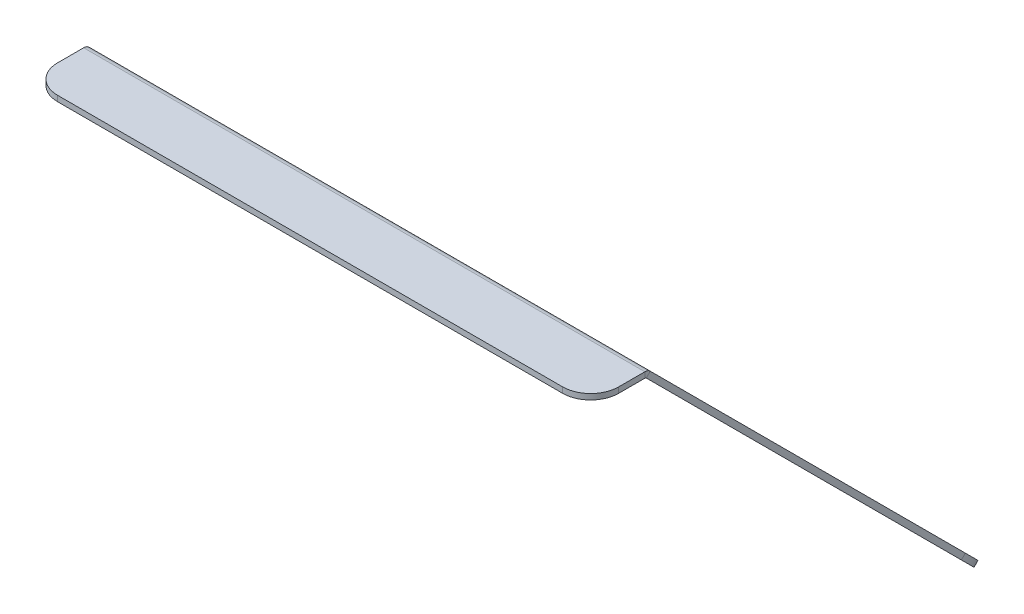
ISO-10303-21;
HEADER;
FILE_DESCRIPTION(('STEP AP214'),'2;1');
FILE_NAME('part.step','',(''),(''),'','','');
FILE_SCHEMA(('AUTOMOTIVE_DESIGN { 1 0 10303 214 1 1 1 1 }'));
ENDSEC;
DATA;
#1=APPLICATION_CONTEXT('core data for automotive mechanical design processes');
#2=APPLICATION_PROTOCOL_DEFINITION('international standard','automotive_design',2000,#1);
#3=PRODUCT_CONTEXT('',#1,'mechanical');
#4=PRODUCT('Part','Part','',(#3));
#5=PRODUCT_RELATED_PRODUCT_CATEGORY('part','',(#4));
#6=PRODUCT_DEFINITION_FORMATION('','',#4);
#7=PRODUCT_DEFINITION_CONTEXT('part definition',#1,'design');
#8=PRODUCT_DEFINITION('design','',#6,#7);
#9=PRODUCT_DEFINITION_SHAPE('','',#8);
#10=(LENGTH_UNIT() NAMED_UNIT(*) SI_UNIT(.MILLI.,.METRE.));
#11=(NAMED_UNIT(*) PLANE_ANGLE_UNIT() SI_UNIT($,.RADIAN.));
#12=(NAMED_UNIT(*) SI_UNIT($,.STERADIAN.) SOLID_ANGLE_UNIT());
#13=UNCERTAINTY_MEASURE_WITH_UNIT(LENGTH_MEASURE(1.E-05),#10,'distance_accuracy_value','');
#14=(GEOMETRIC_REPRESENTATION_CONTEXT(3) GLOBAL_UNCERTAINTY_ASSIGNED_CONTEXT((#13)) GLOBAL_UNIT_ASSIGNED_CONTEXT((#10,
#11,#12)) REPRESENTATION_CONTEXT('',''));
#15=CARTESIAN_POINT('',(0.,0.,0.));
#16=DIRECTION('',(0.,0.,1.));
#17=DIRECTION('',(1.,0.,0.));
#18=AXIS2_PLACEMENT_3D('',#15,#16,#17);
#19=CARTESIAN_POINT('',(80.4190145025555,-114.517057337332,-22.768727575931));
#20=DIRECTION('',(0.,0.707106781186546,-0.707106781186549));
#21=DIRECTION('',(0.,0.707106781186549,0.707106781186546));
#22=AXIS2_PLACEMENT_3D('',#19,#20,#21);
#23=PLANE('',#22);
#24=DIRECTION('',(-1.,0.,0.));
#25=VECTOR('',#24,1.);
#26=CARTESIAN_POINT('',(15.4190145025555,-53.3523207646957,38.3960089967052));
#27=LINE('',#26,#25);
#28=CARTESIAN_POINT('',(65.4190145025556,-53.3523207646957,38.3960089967052));
#29=VERTEX_POINT('',#28);
#30=CARTESIAN_POINT('',(15.4190145025555,-53.3523207646957,38.3960089967052));
#31=VERTEX_POINT('',#30);
#32=EDGE_CURVE('E289',#29,#31,#27,.T.);
#33=ORIENTED_EDGE('',*,*,#32,.T.);
#34=DIRECTION('',(0.,0.707106781186549,0.707106781186546));
#35=VECTOR('',#34,1.);
#36=CARTESIAN_POINT('',(15.4190145025556,-17.9969817053682,73.7513480560325));
#37=LINE('',#36,#35);
#38=CARTESIAN_POINT('',(15.4190145025556,-17.9969817053682,73.7513480560325));
#39=VERTEX_POINT('',#38);
#40=EDGE_CURVE('E276',#31,#39,#37,.T.);
#41=ORIENTED_EDGE('',*,*,#40,.T.);
#42=DIRECTION('',(1.,0.,0.));
#43=VECTOR('',#42,1.);
#44=CARTESIAN_POINT('',(15.4190145025556,-17.9969817053682,73.7513480560325));
#45=LINE('',#44,#43);
#46=CARTESIAN_POINT('',(65.4190145025556,-17.9969817053682,73.7513480560325));
#47=VERTEX_POINT('',#46);
#48=EDGE_CURVE('E280',#39,#47,#45,.T.);
#49=ORIENTED_EDGE('',*,*,#48,.T.);
#50=DIRECTION('',(0.,-0.707106781186549,-0.707106781186546));
#51=VECTOR('',#50,1.);
#52=CARTESIAN_POINT('',(65.4190145025556,-17.9969817053682,73.7513480560325));
#53=LINE('',#52,#51);
#54=EDGE_CURVE('E285',#47,#29,#53,.T.);
#55=ORIENTED_EDGE('',*,*,#54,.T.);
#56=EDGE_LOOP('',(#33,#41,#49,#55));
#57=FACE_BOUND('',#56,.T.);
#58=DIRECTION('',(-1.,0.,0.));
#59=VECTOR('',#58,1.);
#60=CARTESIAN_POINT('',(-14.5809854974445,-53.3523207646957,38.3960089967052));
#61=LINE('',#60,#59);
#62=CARTESIAN_POINT('',(-14.5809854974445,-53.3523207646957,38.3960089967052));
#63=VERTEX_POINT('',#62);
#64=CARTESIAN_POINT('',(-64.5809854974445,-53.3523207646957,38.3960089967052));
#65=VERTEX_POINT('',#64);
#66=EDGE_CURVE('E335',#63,#65,#61,.T.);
#67=ORIENTED_EDGE('',*,*,#66,.T.);
#68=DIRECTION('',(0.,0.707106781186549,0.707106781186546));
#69=VECTOR('',#68,1.);
#70=CARTESIAN_POINT('',(-64.5809854974445,-17.9969817053682,73.7513480560325));
#71=LINE('',#70,#69);
#72=CARTESIAN_POINT('',(-64.5809854974445,-17.9969817053682,73.7513480560325));
#73=VERTEX_POINT('',#72);
#74=EDGE_CURVE('E322',#65,#73,#71,.T.);
#75=ORIENTED_EDGE('',*,*,#74,.T.);
#76=DIRECTION('',(1.,0.,0.));
#77=VECTOR('',#76,1.);
#78=CARTESIAN_POINT('',(-14.5809854974444,-17.9969817053682,73.7513480560325));
#79=LINE('',#78,#77);
#80=CARTESIAN_POINT('',(-14.5809854974444,-17.9969817053683,73.7513480560325));
#81=VERTEX_POINT('',#80);
#82=EDGE_CURVE('E326',#73,#81,#79,.T.);
#83=ORIENTED_EDGE('',*,*,#82,.T.);
#84=DIRECTION('',(0.,-0.707106781186549,-0.707106781186546));
#85=VECTOR('',#84,1.);
#86=CARTESIAN_POINT('',(-14.5809854974444,-17.9969817053682,73.7513480560325));
#87=LINE('',#86,#85);
#88=EDGE_CURVE('E331',#81,#63,#87,.T.);
#89=ORIENTED_EDGE('',*,*,#88,.T.);
#90=EDGE_LOOP('',(#67,#75,#83,#89));
#91=FACE_BOUND('',#90,.T.);
#92=DIRECTION('',(1.,0.,0.));
#93=VECTOR('',#92,1.);
#94=CARTESIAN_POINT('',(-25.5809854974445,-110.981523431399,-19.2331936699983));
#95=LINE('',#94,#93);
#96=CARTESIAN_POINT('',(-25.5809854974445,-110.981523431399,-19.2331936699983));
#97=VERTEX_POINT('',#96);
#98=CARTESIAN_POINT('',(26.4190145025555,-110.981523431399,-19.2331936699983));
#99=VERTEX_POINT('',#98);
#100=EDGE_CURVE('E379',#97,#99,#95,.T.);
#101=ORIENTED_EDGE('',*,*,#100,.T.);
#102=DIRECTION('',(0.,-0.707106781186549,-0.707106781186546));
#103=VECTOR('',#102,1.);
#104=CARTESIAN_POINT('',(26.4190145025555,-110.981523431399,-19.2331936699983));
#105=LINE('',#104,#103);
#106=CARTESIAN_POINT('',(26.4190145025556,-121.588125149198,-29.8397953877965));
#107=VERTEX_POINT('',#106);
#108=EDGE_CURVE('E366',#99,#107,#105,.T.);
#109=ORIENTED_EDGE('',*,*,#108,.T.);
#110=DIRECTION('',(-1.,0.,0.));
#111=VECTOR('',#110,1.);
#112=CARTESIAN_POINT('',(-25.5809854974445,-121.588125149198,-29.8397953877965));
#113=LINE('',#112,#111);
#114=CARTESIAN_POINT('',(-25.5809854974445,-121.588125149198,-29.8397953877965));
#115=VERTEX_POINT('',#114);
#116=EDGE_CURVE('E370',#107,#115,#113,.T.);
#117=ORIENTED_EDGE('',*,*,#116,.T.);
#118=DIRECTION('',(0.,0.707106781186549,0.707106781186546));
#119=VECTOR('',#118,1.);
#120=CARTESIAN_POINT('',(-25.5809854974445,-110.981523431399,-19.2331936699983));
#121=LINE('',#120,#119);
#122=EDGE_CURVE('E375',#115,#97,#121,.T.);
#123=ORIENTED_EDGE('',*,*,#122,.T.);
#124=EDGE_LOOP('',(#101,#109,#117,#123));
#125=FACE_BOUND('',#124,.T.);
#126=CARTESIAN_POINT('',(-69.5809854974445,-84.1114657463105,7.63686401509044));
#127=DIRECTION('',(0.,0.707106781186546,-0.707106781186549));
#128=DIRECTION('',(0.,0.707106781186549,0.707106781186546));
#129=AXIS2_PLACEMENT_3D('',#126,#127,#128);
#130=CIRCLE('',#129,1.54999999999999);
#131=CARTESIAN_POINT('',(-69.5809854974445,-83.0154502354714,8.73287952592958));
#132=VERTEX_POINT('',#131);
#133=EDGE_CURVE('E410',#132,#132,#130,.T.);
#134=ORIENTED_EDGE('',*,*,#133,.T.);
#135=EDGE_LOOP('',(#134));
#136=FACE_BOUND('',#135,.T.);
#137=CARTESIAN_POINT('',(70.4190145025556,-84.1114657463106,7.63686401509045));
#138=DIRECTION('',(0.,0.707106781186546,-0.707106781186549));
#139=DIRECTION('',(0.,0.707106781186549,0.707106781186546));
#140=AXIS2_PLACEMENT_3D('',#137,#138,#139);
#141=CIRCLE('',#140,1.54999999999999);
#142=CARTESIAN_POINT('',(70.4190145025556,-83.0154502354714,8.73287952592959));
#143=VERTEX_POINT('',#142);
#144=EDGE_CURVE('E418',#143,#143,#141,.T.);
#145=ORIENTED_EDGE('',*,*,#144,.T.);
#146=EDGE_LOOP('',(#145));
#147=FACE_BOUND('',#146,.T.);
#148=DIRECTION('',(0.,-0.707106781186549,-0.707106781186546));
#149=VECTOR('',#148,1.);
#150=CARTESIAN_POINT('',(100.419014502556,-114.517057337332,-22.7687275759309));
#151=LINE('',#150,#149);
#152=CARTESIAN_POINT('',(100.419014502556,-2.21574514497799,89.5325846164227));
#153=VERTEX_POINT('',#152);
#154=CARTESIAN_POINT('',(100.419014502556,-114.517057337332,-22.7687275759309));
#155=VERTEX_POINT('',#154);
#156=EDGE_CURVE('E50',#153,#155,#151,.T.);
#157=ORIENTED_EDGE('',*,*,#156,.F.);
#158=DIRECTION('',(-1.,0.,0.));
#159=VECTOR('',#158,1.);
#160=CARTESIAN_POINT('',(80.4190145025555,-2.21574514497799,89.5325846164227));
#161=LINE('',#160,#159);
#162=CARTESIAN_POINT('',(-99.5809854974445,-2.215745144978,89.5325846164227));
#163=VERTEX_POINT('',#162);
#164=EDGE_CURVE('E235',#153,#163,#161,.T.);
#165=ORIENTED_EDGE('',*,*,#164,.T.);
#166=DIRECTION('',(0.,0.707106781186549,0.707106781186546));
#167=VECTOR('',#166,1.);
#168=CARTESIAN_POINT('',(-99.5809854974445,-114.517057337332,-22.768727575931));
#169=LINE('',#168,#167);
#170=CARTESIAN_POINT('',(-99.5809854974445,-114.517057337332,-22.768727575931));
#171=VERTEX_POINT('',#170);
#172=EDGE_CURVE('E438',#171,#163,#169,.T.);
#173=ORIENTED_EDGE('',*,*,#172,.F.);
#174=CARTESIAN_POINT('',(-79.5809854974445,-114.517057337332,-22.7687275759311));
#175=DIRECTION('',(0.,0.707106781186546,-0.707106781186549));
#176=DIRECTION('',(0.,-0.707106781186549,-0.707106781186546));
#177=AXIS2_PLACEMENT_3D('',#174,#175,#176);
#178=CIRCLE('',#177,20.);
#179=CARTESIAN_POINT('',(-79.5809854974445,-128.659192961063,-36.910863199662));
#180=VERTEX_POINT('',#179);
#181=EDGE_CURVE('E434',#180,#171,#178,.T.);
#182=ORIENTED_EDGE('',*,*,#181,.F.);
#183=DIRECTION('',(-1.,0.,0.));
#184=VECTOR('',#183,1.);
#185=CARTESIAN_POINT('',(-79.5809854974443,-128.659192961063,-36.910863199662));
#186=LINE('',#185,#184);
#187=CARTESIAN_POINT('',(80.4190145025554,-128.659192961063,-36.910863199662));
#188=VERTEX_POINT('',#187);
#189=EDGE_CURVE('E430',#188,#180,#186,.T.);
#190=ORIENTED_EDGE('',*,*,#189,.F.);
#191=CARTESIAN_POINT('',(80.4190145025555,-114.517057337332,-22.768727575931));
#192=DIRECTION('',(0.,0.707106781186546,-0.707106781186549));
#193=DIRECTION('',(0.,0.707106781186549,0.707106781186546));
#194=AXIS2_PLACEMENT_3D('',#191,#192,#193);
#195=CIRCLE('',#194,20.);
#196=EDGE_CURVE('E426',#155,#188,#195,.T.);
#197=ORIENTED_EDGE('',*,*,#196,.F.);
#198=EDGE_LOOP('',(#157,#165,#173,#182,#190,#197));
#199=FACE_BOUND('',#198,.T.);
#200=ADVANCED_FACE('F46',(#57,#91,#125,#136,#147,#199),#23,.F.);
#201=CARTESIAN_POINT('',(80.4190145025555,-114.517057337332,-22.768727575931));
#202=DIRECTION('',(0.,0.707106781186546,-0.707106781186549));
#203=DIRECTION('',(0.,0.707106781186549,0.707106781186546));
#204=AXIS2_PLACEMENT_3D('',#201,#202,#203);
#205=CYLINDRICAL_SURFACE('',#204,20.);
#206=CARTESIAN_POINT('',(80.4190145025555,-113.102843774959,-24.1829411383041));
#207=DIRECTION('',(0.,0.707106781186546,-0.707106781186549));
#208=DIRECTION('',(0.,0.707106781186549,0.707106781186546));
#209=AXIS2_PLACEMENT_3D('',#206,#207,#208);
#210=CIRCLE('',#209,20.);
#211=CARTESIAN_POINT('',(100.419014502556,-113.102843774959,-24.182941138304));
#212=VERTEX_POINT('',#211);
#213=CARTESIAN_POINT('',(80.4190145025554,-127.24497939869,-38.3250767620351));
#214=VERTEX_POINT('',#213);
#215=EDGE_CURVE('E422',#212,#214,#210,.T.);
#216=ORIENTED_EDGE('',*,*,#215,.F.);
#217=DIRECTION('',(0.,0.707106781186546,-0.707106781186549));
#218=VECTOR('',#217,1.);
#219=CARTESIAN_POINT('',(100.419014502556,-114.517057337332,-22.7687275759309));
#220=LINE('',#219,#218);
#221=EDGE_CURVE('E449',#155,#212,#220,.T.);
#222=ORIENTED_EDGE('',*,*,#221,.F.);
#223=ORIENTED_EDGE('',*,*,#196,.T.);
#224=DIRECTION('',(0.,0.707106781186546,-0.707106781186549));
#225=VECTOR('',#224,1.);
#226=CARTESIAN_POINT('',(80.4190145025554,-128.659192961063,-36.910863199662));
#227=LINE('',#226,#225);
#228=EDGE_CURVE('E458',#188,#214,#227,.T.);
#229=ORIENTED_EDGE('',*,*,#228,.T.);
#230=EDGE_LOOP('',(#216,#222,#223,#229));
#231=FACE_BOUND('',#230,.T.);
#232=ADVANCED_FACE('F480',(#231),#205,.T.);
#233=CARTESIAN_POINT('',(100.419014502556,-114.517057337332,-22.7687275759309));
#234=DIRECTION('',(1.,0.,0.));
#235=DIRECTION('',(0.,-0.707106781186549,-0.707106781186546));
#236=AXIS2_PLACEMENT_3D('',#233,#234,#235);
#237=PLANE('',#236);
#238=DIRECTION('',(0.,0.707106781186546,-0.707106781186549));
#239=VECTOR('',#238,1.);
#240=CARTESIAN_POINT('',(100.419014502556,-2.215745144978,89.5325846164227));
#241=LINE('',#240,#239);
#242=CARTESIAN_POINT('',(100.419014502556,-0.801531582604903,88.1183710540496));
#243=VERTEX_POINT('',#242);
#244=EDGE_CURVE('E463',#153,#243,#241,.T.);
#245=ORIENTED_EDGE('',*,*,#244,.F.);
#246=ORIENTED_EDGE('',*,*,#156,.T.);
#247=ORIENTED_EDGE('',*,*,#221,.T.);
#248=DIRECTION('',(0.,-0.707106781186549,-0.707106781186546));
#249=VECTOR('',#248,1.);
#250=CARTESIAN_POINT('',(100.419014502556,-113.102843774959,-24.182941138304));
#251=LINE('',#250,#249);
#252=EDGE_CURVE('E72',#243,#212,#251,.T.);
#253=ORIENTED_EDGE('',*,*,#252,.F.);
#254=EDGE_LOOP('',(#245,#246,#247,#253));
#255=FACE_BOUND('',#254,.T.);
#256=ADVANCED_FACE('F477',(#255),#237,.T.);
#257=CARTESIAN_POINT('',(-99.5809854974445,-114.517057337332,-22.768727575931));
#258=DIRECTION('',(-1.,0.,0.));
#259=DIRECTION('',(0.,0.707106781186549,0.707106781186546));
#260=AXIS2_PLACEMENT_3D('',#257,#258,#259);
#261=PLANE('',#260);
#262=DIRECTION('',(0.,-0.707106781186546,0.707106781186549));
#263=VECTOR('',#262,1.);
#264=CARTESIAN_POINT('',(-99.5809854974445,-2.21574514497801,89.5325846164227));
#265=LINE('',#264,#263);
#266=CARTESIAN_POINT('',(-99.5809854974445,-0.801531582604931,88.1183710540496));
#267=VERTEX_POINT('',#266);
#268=EDGE_CURVE('E12',#267,#163,#265,.T.);
#269=ORIENTED_EDGE('',*,*,#268,.F.);
#270=DIRECTION('',(0.,0.707106781186549,0.707106781186546));
#271=VECTOR('',#270,1.);
#272=CARTESIAN_POINT('',(-99.5809854974445,-113.102843774959,-24.1829411383041));
#273=LINE('',#272,#271);
#274=CARTESIAN_POINT('',(-99.5809854974445,-113.102843774959,-24.1829411383041));
#275=VERTEX_POINT('',#274);
#276=EDGE_CURVE('E64',#275,#267,#273,.T.);
#277=ORIENTED_EDGE('',*,*,#276,.F.);
#278=DIRECTION('',(0.,0.707106781186546,-0.707106781186549));
#279=VECTOR('',#278,1.);
#280=CARTESIAN_POINT('',(-99.5809854974445,-114.517057337332,-22.768727575931));
#281=LINE('',#280,#279);
#282=EDGE_CURVE('E452',#171,#275,#281,.T.);
#283=ORIENTED_EDGE('',*,*,#282,.F.);
#284=ORIENTED_EDGE('',*,*,#172,.T.);
#285=EDGE_LOOP('',(#269,#277,#283,#284));
#286=FACE_BOUND('',#285,.T.);
#287=ADVANCED_FACE('F48',(#286),#261,.T.);
#288=CARTESIAN_POINT('',(-79.5809854974445,-114.517057337332,-22.7687275759311));
#289=DIRECTION('',(0.,0.707106781186546,-0.707106781186549));
#290=DIRECTION('',(0.,0.707106781186549,0.707106781186546));
#291=AXIS2_PLACEMENT_3D('',#288,#289,#290);
#292=CYLINDRICAL_SURFACE('',#291,20.);
#293=CARTESIAN_POINT('',(-79.5809854974445,-113.102843774959,-24.1829411383042));
#294=DIRECTION('',(0.,0.707106781186546,-0.707106781186549));
#295=DIRECTION('',(0.,-0.707106781186549,-0.707106781186546));
#296=AXIS2_PLACEMENT_3D('',#293,#294,#295);
#297=CIRCLE('',#296,20.);
#298=CARTESIAN_POINT('',(-79.5809854974445,-127.24497939869,-38.3250767620351));
#299=VERTEX_POINT('',#298);
#300=EDGE_CURVE('E446',#299,#275,#297,.T.);
#301=ORIENTED_EDGE('',*,*,#300,.F.);
#302=DIRECTION('',(0.,0.707106781186546,-0.707106781186549));
#303=VECTOR('',#302,1.);
#304=CARTESIAN_POINT('',(-79.5809854974445,-128.659192961063,-36.910863199662));
#305=LINE('',#304,#303);
#306=EDGE_CURVE('E455',#180,#299,#305,.T.);
#307=ORIENTED_EDGE('',*,*,#306,.F.);
#308=ORIENTED_EDGE('',*,*,#181,.T.);
#309=ORIENTED_EDGE('',*,*,#282,.T.);
#310=EDGE_LOOP('',(#301,#307,#308,#309));
#311=FACE_BOUND('',#310,.T.);
#312=ADVANCED_FACE('F487',(#311),#292,.T.);
#313=CARTESIAN_POINT('',(-79.5809854974443,-128.659192961063,-36.910863199662));
#314=DIRECTION('',(0.,-0.707106781186549,-0.707106781186546));
#315=DIRECTION('',(-1.,0.,0.));
#316=AXIS2_PLACEMENT_3D('',#313,#314,#315);
#317=PLANE('',#316);
#318=DIRECTION('',(-1.,0.,0.));
#319=VECTOR('',#318,1.);
#320=CARTESIAN_POINT('',(-79.5809854974443,-127.24497939869,-38.3250767620351));
#321=LINE('',#320,#319);
#322=EDGE_CURVE('E442',#214,#299,#321,.T.);
#323=ORIENTED_EDGE('',*,*,#322,.F.);
#324=ORIENTED_EDGE('',*,*,#228,.F.);
#325=ORIENTED_EDGE('',*,*,#189,.T.);
#326=ORIENTED_EDGE('',*,*,#306,.T.);
#327=EDGE_LOOP('',(#323,#324,#325,#326));
#328=FACE_BOUND('',#327,.T.);
#329=ADVANCED_FACE('F484',(#328),#317,.T.);
#330=CARTESIAN_POINT('',(80.4190145025555,-113.102843774959,-24.1829411383041));
#331=DIRECTION('',(0.,0.707106781186546,-0.707106781186549));
#332=DIRECTION('',(0.,0.707106781186549,0.707106781186546));
#333=AXIS2_PLACEMENT_3D('',#330,#331,#332);
#334=PLANE('',#333);
#335=DIRECTION('',(-1.,0.,0.));
#336=VECTOR('',#335,1.);
#337=CARTESIAN_POINT('',(80.4190145025555,-0.801531582604903,88.1183710540496));
#338=LINE('',#337,#336);
#339=EDGE_CURVE('E56',#243,#267,#338,.T.);
#340=ORIENTED_EDGE('',*,*,#339,.F.);
#341=ORIENTED_EDGE('',*,*,#252,.T.);
#342=ORIENTED_EDGE('',*,*,#215,.T.);
#343=ORIENTED_EDGE('',*,*,#322,.T.);
#344=ORIENTED_EDGE('',*,*,#300,.T.);
#345=ORIENTED_EDGE('',*,*,#276,.T.);
#346=EDGE_LOOP('',(#340,#341,#342,#343,#344,#345));
#347=FACE_BOUND('',#346,.T.);
#348=DIRECTION('',(0.,0.707106781186549,0.707106781186546));
#349=VECTOR('',#348,1.);
#350=CARTESIAN_POINT('',(15.4190145025556,-16.5827681429951,72.3371344936594));
#351=LINE('',#350,#349);
#352=CARTESIAN_POINT('',(15.4190145025555,-51.9381072023226,36.9817954343321));
#353=VERTEX_POINT('',#352);
#354=CARTESIAN_POINT('',(15.4190145025556,-16.5827681429951,72.3371344936594));
#355=VERTEX_POINT('',#354);
#356=EDGE_CURVE('E294',#353,#355,#351,.T.);
#357=ORIENTED_EDGE('',*,*,#356,.F.);
#358=DIRECTION('',(-1.,0.,0.));
#359=VECTOR('',#358,1.);
#360=CARTESIAN_POINT('',(15.4190145025555,-51.9381072023226,36.9817954343321));
#361=LINE('',#360,#359);
#362=CARTESIAN_POINT('',(65.4190145025556,-51.9381072023226,36.9817954343321));
#363=VERTEX_POINT('',#362);
#364=EDGE_CURVE('E281',#363,#353,#361,.T.);
#365=ORIENTED_EDGE('',*,*,#364,.F.);
#366=DIRECTION('',(0.,-0.707106781186549,-0.707106781186546));
#367=VECTOR('',#366,1.);
#368=CARTESIAN_POINT('',(65.4190145025556,-16.5827681429952,72.3371344936594));
#369=LINE('',#368,#367);
#370=CARTESIAN_POINT('',(65.4190145025556,-16.5827681429952,72.3371344936594));
#371=VERTEX_POINT('',#370);
#372=EDGE_CURVE('E302',#371,#363,#369,.T.);
#373=ORIENTED_EDGE('',*,*,#372,.F.);
#374=DIRECTION('',(1.,0.,0.));
#375=VECTOR('',#374,1.);
#376=CARTESIAN_POINT('',(15.4190145025556,-16.5827681429951,72.3371344936594));
#377=LINE('',#376,#375);
#378=EDGE_CURVE('E297',#355,#371,#377,.T.);
#379=ORIENTED_EDGE('',*,*,#378,.F.);
#380=EDGE_LOOP('',(#357,#365,#373,#379));
#381=FACE_BOUND('',#380,.T.);
#382=DIRECTION('',(0.,0.707106781186549,0.707106781186546));
#383=VECTOR('',#382,1.);
#384=CARTESIAN_POINT('',(-64.5809854974445,-16.5827681429951,72.3371344936594));
#385=LINE('',#384,#383);
#386=CARTESIAN_POINT('',(-64.5809854974445,-51.9381072023226,36.9817954343321));
#387=VERTEX_POINT('',#386);
#388=CARTESIAN_POINT('',(-64.5809854974445,-16.5827681429952,72.3371344936594));
#389=VERTEX_POINT('',#388);
#390=EDGE_CURVE('E312',#387,#389,#385,.T.);
#391=ORIENTED_EDGE('',*,*,#390,.F.);
#392=DIRECTION('',(-1.,0.,0.));
#393=VECTOR('',#392,1.);
#394=CARTESIAN_POINT('',(-14.5809854974445,-51.9381072023226,36.9817954343321));
#395=LINE('',#394,#393);
#396=CARTESIAN_POINT('',(-14.5809854974445,-51.9381072023226,36.9817954343321));
#397=VERTEX_POINT('',#396);
#398=EDGE_CURVE('E327',#397,#387,#395,.T.);
#399=ORIENTED_EDGE('',*,*,#398,.F.);
#400=DIRECTION('',(0.,-0.707106781186549,-0.707106781186546));
#401=VECTOR('',#400,1.);
#402=CARTESIAN_POINT('',(-14.5809854974444,-16.5827681429952,72.3371344936594));
#403=LINE('',#402,#401);
#404=CARTESIAN_POINT('',(-14.5809854974444,-16.5827681429952,72.3371344936594));
#405=VERTEX_POINT('',#404);
#406=EDGE_CURVE('E346',#405,#397,#403,.T.);
#407=ORIENTED_EDGE('',*,*,#406,.F.);
#408=DIRECTION('',(1.,0.,0.));
#409=VECTOR('',#408,1.);
#410=CARTESIAN_POINT('',(-14.5809854974444,-16.5827681429952,72.3371344936594));
#411=LINE('',#410,#409);
#412=EDGE_CURVE('E342',#389,#405,#411,.T.);
#413=ORIENTED_EDGE('',*,*,#412,.F.);
#414=EDGE_LOOP('',(#391,#399,#407,#413));
#415=FACE_BOUND('',#414,.T.);
#416=DIRECTION('',(0.,-0.707106781186549,-0.707106781186546));
#417=VECTOR('',#416,1.);
#418=CARTESIAN_POINT('',(26.4190145025555,-109.567309869026,-20.6474072323714));
#419=LINE('',#418,#417);
#420=CARTESIAN_POINT('',(26.4190145025555,-109.567309869026,-20.6474072323714));
#421=VERTEX_POINT('',#420);
#422=CARTESIAN_POINT('',(26.4190145025556,-120.173911586825,-31.2540089501696));
#423=VERTEX_POINT('',#422);
#424=EDGE_CURVE('E356',#421,#423,#419,.T.);
#425=ORIENTED_EDGE('',*,*,#424,.F.);
#426=DIRECTION('',(1.,0.,0.));
#427=VECTOR('',#426,1.);
#428=CARTESIAN_POINT('',(-25.5809854974445,-109.567309869026,-20.6474072323714));
#429=LINE('',#428,#427);
#430=CARTESIAN_POINT('',(-25.5809854974445,-109.567309869026,-20.6474072323714));
#431=VERTEX_POINT('',#430);
#432=EDGE_CURVE('E371',#431,#421,#429,.T.);
#433=ORIENTED_EDGE('',*,*,#432,.F.);
#434=DIRECTION('',(0.,0.707106781186549,0.707106781186546));
#435=VECTOR('',#434,1.);
#436=CARTESIAN_POINT('',(-25.5809854974445,-109.567309869026,-20.6474072323714));
#437=LINE('',#436,#435);
#438=CARTESIAN_POINT('',(-25.5809854974445,-120.173911586825,-31.2540089501696));
#439=VERTEX_POINT('',#438);
#440=EDGE_CURVE('E390',#439,#431,#437,.T.);
#441=ORIENTED_EDGE('',*,*,#440,.F.);
#442=DIRECTION('',(-1.,0.,0.));
#443=VECTOR('',#442,1.);
#444=CARTESIAN_POINT('',(-25.5809854974445,-120.173911586825,-31.2540089501696));
#445=LINE('',#444,#443);
#446=EDGE_CURVE('E386',#423,#439,#445,.T.);
#447=ORIENTED_EDGE('',*,*,#446,.F.);
#448=EDGE_LOOP('',(#425,#433,#441,#447));
#449=FACE_BOUND('',#448,.T.);
#450=CARTESIAN_POINT('',(-69.5809854974445,-82.6972521839375,6.22265045271734));
#451=DIRECTION('',(0.,0.707106781186546,-0.707106781186549));
#452=DIRECTION('',(0.,0.707106781186549,0.707106781186546));
#453=AXIS2_PLACEMENT_3D('',#450,#451,#452);
#454=CIRCLE('',#453,1.54999999999999);
#455=CARTESIAN_POINT('',(-69.5809854974445,-81.6012366730983,7.31866596355648));
#456=VERTEX_POINT('',#455);
#457=EDGE_CURVE('E400',#456,#456,#454,.T.);
#458=ORIENTED_EDGE('',*,*,#457,.F.);
#459=EDGE_LOOP('',(#458));
#460=FACE_BOUND('',#459,.T.);
#461=CARTESIAN_POINT('',(70.4190145025556,-82.6972521839375,6.22265045271735));
#462=DIRECTION('',(0.,0.707106781186546,-0.707106781186549));
#463=DIRECTION('',(0.,0.707106781186549,0.707106781186546));
#464=AXIS2_PLACEMENT_3D('',#461,#462,#463);
#465=CIRCLE('',#464,1.54999999999999);
#466=CARTESIAN_POINT('',(70.4190145025556,-81.6012366730983,7.31866596355649));
#467=VERTEX_POINT('',#466);
#468=EDGE_CURVE('E414',#467,#467,#465,.T.);
#469=ORIENTED_EDGE('',*,*,#468,.F.);
#470=EDGE_LOOP('',(#469));
#471=FACE_BOUND('',#470,.T.);
#472=ADVANCED_FACE('F473',(#347,#381,#415,#449,#460,#471),#334,.T.);
#473=CARTESIAN_POINT('',(70.4190145025556,-84.1114657463106,7.63686401509045));
#474=DIRECTION('',(0.,0.707106781186546,-0.707106781186549));
#475=DIRECTION('',(0.,0.707106781186549,0.707106781186546));
#476=AXIS2_PLACEMENT_3D('',#473,#474,#475);
#477=CYLINDRICAL_SURFACE('',#476,1.54999999999999);
#478=ORIENTED_EDGE('',*,*,#144,.F.);
#479=EDGE_LOOP('',(#478));
#480=FACE_BOUND('',#479,.T.);
#481=ORIENTED_EDGE('',*,*,#468,.T.);
#482=EDGE_LOOP('',(#481));
#483=FACE_BOUND('',#482,.T.);
#484=ADVANCED_FACE('F568',(#480,#483),#477,.F.);
#485=CARTESIAN_POINT('',(-69.5809854974445,-84.1114657463105,7.63686401509044));
#486=DIRECTION('',(0.,0.707106781186546,-0.707106781186549));
#487=DIRECTION('',(0.,0.707106781186549,0.707106781186546));
#488=AXIS2_PLACEMENT_3D('',#485,#486,#487);
#489=CYLINDRICAL_SURFACE('',#488,1.54999999999999);
#490=ORIENTED_EDGE('',*,*,#133,.F.);
#491=EDGE_LOOP('',(#490));
#492=FACE_BOUND('',#491,.T.);
#493=ORIENTED_EDGE('',*,*,#457,.T.);
#494=EDGE_LOOP('',(#493));
#495=FACE_BOUND('',#494,.T.);
#496=ADVANCED_FACE('F573',(#492,#495),#489,.F.);
#497=CARTESIAN_POINT('',(26.4190145025555,-110.981523431399,-19.2331936699983));
#498=DIRECTION('',(1.,0.,0.));
#499=DIRECTION('',(0.,-0.707106781186549,-0.707106781186546));
#500=AXIS2_PLACEMENT_3D('',#497,#498,#499);
#501=PLANE('',#500);
#502=ORIENTED_EDGE('',*,*,#424,.T.);
#503=DIRECTION('',(0.,0.707106781186546,-0.707106781186549));
#504=VECTOR('',#503,1.);
#505=CARTESIAN_POINT('',(26.4190145025556,-121.588125149198,-29.8397953877965));
#506=LINE('',#505,#504);
#507=EDGE_CURVE('E383',#107,#423,#506,.T.);
#508=ORIENTED_EDGE('',*,*,#507,.F.);
#509=ORIENTED_EDGE('',*,*,#108,.F.);
#510=DIRECTION('',(0.,0.707106781186546,-0.707106781186549));
#511=VECTOR('',#510,1.);
#512=CARTESIAN_POINT('',(26.4190145025555,-110.981523431399,-19.2331936699983));
#513=LINE('',#512,#511);
#514=EDGE_CURVE('E397',#99,#421,#513,.T.);
#515=ORIENTED_EDGE('',*,*,#514,.T.);
#516=EDGE_LOOP('',(#502,#508,#509,#515));
#517=FACE_BOUND('',#516,.T.);
#518=ADVANCED_FACE('F583',(#517),#501,.F.);
#519=CARTESIAN_POINT('',(-25.5809854974445,-110.981523431399,-19.2331936699983));
#520=DIRECTION('',(0.,0.707106781186549,0.707106781186546));
#521=DIRECTION('',(1.,0.,0.));
#522=AXIS2_PLACEMENT_3D('',#519,#520,#521);
#523=PLANE('',#522);
#524=ORIENTED_EDGE('',*,*,#432,.T.);
#525=ORIENTED_EDGE('',*,*,#514,.F.);
#526=ORIENTED_EDGE('',*,*,#100,.F.);
#527=DIRECTION('',(0.,0.707106781186546,-0.707106781186549));
#528=VECTOR('',#527,1.);
#529=CARTESIAN_POINT('',(-25.5809854974445,-110.981523431399,-19.2331936699983));
#530=LINE('',#529,#528);
#531=EDGE_CURVE('E401',#97,#431,#530,.T.);
#532=ORIENTED_EDGE('',*,*,#531,.T.);
#533=EDGE_LOOP('',(#524,#525,#526,#532));
#534=FACE_BOUND('',#533,.T.);
#535=ADVANCED_FACE('F587',(#534),#523,.F.);
#536=CARTESIAN_POINT('',(-25.5809854974445,-110.981523431399,-19.2331936699983));
#537=DIRECTION('',(-1.,0.,0.));
#538=DIRECTION('',(0.,0.707106781186549,0.707106781186546));
#539=AXIS2_PLACEMENT_3D('',#536,#537,#538);
#540=PLANE('',#539);
#541=ORIENTED_EDGE('',*,*,#440,.T.);
#542=ORIENTED_EDGE('',*,*,#531,.F.);
#543=ORIENTED_EDGE('',*,*,#122,.F.);
#544=DIRECTION('',(0.,0.707106781186546,-0.707106781186549));
#545=VECTOR('',#544,1.);
#546=CARTESIAN_POINT('',(-25.5809854974445,-121.588125149198,-29.8397953877965));
#547=LINE('',#546,#545);
#548=EDGE_CURVE('E404',#115,#439,#547,.T.);
#549=ORIENTED_EDGE('',*,*,#548,.T.);
#550=EDGE_LOOP('',(#541,#542,#543,#549));
#551=FACE_BOUND('',#550,.T.);
#552=ADVANCED_FACE('F593',(#551),#540,.F.);
#553=CARTESIAN_POINT('',(-25.5809854974445,-121.588125149198,-29.8397953877965));
#554=DIRECTION('',(0.,-0.707106781186549,-0.707106781186546));
#555=DIRECTION('',(-1.,0.,0.));
#556=AXIS2_PLACEMENT_3D('',#553,#554,#555);
#557=PLANE('',#556);
#558=ORIENTED_EDGE('',*,*,#446,.T.);
#559=ORIENTED_EDGE('',*,*,#548,.F.);
#560=ORIENTED_EDGE('',*,*,#116,.F.);
#561=ORIENTED_EDGE('',*,*,#507,.T.);
#562=EDGE_LOOP('',(#558,#559,#560,#561));
#563=FACE_BOUND('',#562,.T.);
#564=ADVANCED_FACE('F589',(#563),#557,.F.);
#565=CARTESIAN_POINT('',(-64.5809854974445,-17.9969817053682,73.7513480560325));
#566=DIRECTION('',(-1.,0.,0.));
#567=DIRECTION('',(0.,0.707106781186549,0.707106781186546));
#568=AXIS2_PLACEMENT_3D('',#565,#566,#567);
#569=PLANE('',#568);
#570=ORIENTED_EDGE('',*,*,#390,.T.);
#571=DIRECTION('',(0.,0.707106781186546,-0.707106781186549));
#572=VECTOR('',#571,1.);
#573=CARTESIAN_POINT('',(-64.5809854974445,-17.9969817053682,73.7513480560325));
#574=LINE('',#573,#572);
#575=EDGE_CURVE('E339',#73,#389,#574,.T.);
#576=ORIENTED_EDGE('',*,*,#575,.F.);
#577=ORIENTED_EDGE('',*,*,#74,.F.);
#578=DIRECTION('',(0.,0.707106781186546,-0.707106781186549));
#579=VECTOR('',#578,1.);
#580=CARTESIAN_POINT('',(-64.5809854974445,-53.3523207646957,38.3960089967052));
#581=LINE('',#580,#579);
#582=EDGE_CURVE('E353',#65,#387,#581,.T.);
#583=ORIENTED_EDGE('',*,*,#582,.T.);
#584=EDGE_LOOP('',(#570,#576,#577,#583));
#585=FACE_BOUND('',#584,.T.);
#586=ADVANCED_FACE('F592',(#585),#569,.F.);
#587=CARTESIAN_POINT('',(-14.5809854974445,-53.3523207646957,38.3960089967052));
#588=DIRECTION('',(0.,-0.707106781186549,-0.707106781186546));
#589=DIRECTION('',(-1.,0.,0.));
#590=AXIS2_PLACEMENT_3D('',#587,#588,#589);
#591=PLANE('',#590);
#592=ORIENTED_EDGE('',*,*,#398,.T.);
#593=ORIENTED_EDGE('',*,*,#582,.F.);
#594=ORIENTED_EDGE('',*,*,#66,.F.);
#595=DIRECTION('',(0.,0.707106781186546,-0.707106781186549));
#596=VECTOR('',#595,1.);
#597=CARTESIAN_POINT('',(-14.5809854974445,-53.3523207646957,38.3960089967052));
#598=LINE('',#597,#596);
#599=EDGE_CURVE('E357',#63,#397,#598,.T.);
#600=ORIENTED_EDGE('',*,*,#599,.T.);
#601=EDGE_LOOP('',(#592,#593,#594,#600));
#602=FACE_BOUND('',#601,.T.);
#603=ADVANCED_FACE('F603',(#602),#591,.F.);
#604=CARTESIAN_POINT('',(-14.5809854974444,-17.9969817053682,73.7513480560325));
#605=DIRECTION('',(1.,0.,0.));
#606=DIRECTION('',(0.,-0.707106781186549,-0.707106781186546));
#607=AXIS2_PLACEMENT_3D('',#604,#605,#606);
#608=PLANE('',#607);
#609=ORIENTED_EDGE('',*,*,#406,.T.);
#610=ORIENTED_EDGE('',*,*,#599,.F.);
#611=ORIENTED_EDGE('',*,*,#88,.F.);
#612=DIRECTION('',(0.,0.707106781186546,-0.707106781186549));
#613=VECTOR('',#612,1.);
#614=CARTESIAN_POINT('',(-14.5809854974444,-17.9969817053682,73.7513480560325));
#615=LINE('',#614,#613);
#616=EDGE_CURVE('E360',#81,#405,#615,.T.);
#617=ORIENTED_EDGE('',*,*,#616,.T.);
#618=EDGE_LOOP('',(#609,#610,#611,#617));
#619=FACE_BOUND('',#618,.T.);
#620=ADVANCED_FACE('F609',(#619),#608,.F.);
#621=CARTESIAN_POINT('',(-14.5809854974444,-17.9969817053682,73.7513480560325));
#622=DIRECTION('',(0.,0.707106781186549,0.707106781186546));
#623=DIRECTION('',(1.,0.,0.));
#624=AXIS2_PLACEMENT_3D('',#621,#622,#623);
#625=PLANE('',#624);
#626=ORIENTED_EDGE('',*,*,#412,.T.);
#627=ORIENTED_EDGE('',*,*,#616,.F.);
#628=ORIENTED_EDGE('',*,*,#82,.F.);
#629=ORIENTED_EDGE('',*,*,#575,.T.);
#630=EDGE_LOOP('',(#626,#627,#628,#629));
#631=FACE_BOUND('',#630,.T.);
#632=ADVANCED_FACE('F605',(#631),#625,.F.);
#633=CARTESIAN_POINT('',(15.4190145025556,-17.9969817053682,73.7513480560325));
#634=DIRECTION('',(-1.,0.,0.));
#635=DIRECTION('',(0.,0.707106781186549,0.707106781186546));
#636=AXIS2_PLACEMENT_3D('',#633,#634,#635);
#637=PLANE('',#636);
#638=ORIENTED_EDGE('',*,*,#356,.T.);
#639=DIRECTION('',(0.,0.707106781186546,-0.707106781186549));
#640=VECTOR('',#639,1.);
#641=CARTESIAN_POINT('',(15.4190145025556,-17.9969817053682,73.7513480560325));
#642=LINE('',#641,#640);
#643=EDGE_CURVE('E293',#39,#355,#642,.T.);
#644=ORIENTED_EDGE('',*,*,#643,.F.);
#645=ORIENTED_EDGE('',*,*,#40,.F.);
#646=DIRECTION('',(0.,0.707106781186546,-0.707106781186549));
#647=VECTOR('',#646,1.);
#648=CARTESIAN_POINT('',(15.4190145025555,-53.3523207646957,38.3960089967052));
#649=LINE('',#648,#647);
#650=EDGE_CURVE('E309',#31,#353,#649,.T.);
#651=ORIENTED_EDGE('',*,*,#650,.T.);
#652=EDGE_LOOP('',(#638,#644,#645,#651));
#653=FACE_BOUND('',#652,.T.);
#654=ADVANCED_FACE('F608',(#653),#637,.F.);
#655=CARTESIAN_POINT('',(15.4190145025555,-53.3523207646957,38.3960089967052));
#656=DIRECTION('',(0.,-0.707106781186549,-0.707106781186546));
#657=DIRECTION('',(-1.,0.,0.));
#658=AXIS2_PLACEMENT_3D('',#655,#656,#657);
#659=PLANE('',#658);
#660=ORIENTED_EDGE('',*,*,#364,.T.);
#661=ORIENTED_EDGE('',*,*,#650,.F.);
#662=ORIENTED_EDGE('',*,*,#32,.F.);
#663=DIRECTION('',(0.,0.707106781186546,-0.707106781186549));
#664=VECTOR('',#663,1.);
#665=CARTESIAN_POINT('',(65.4190145025556,-53.3523207646957,38.3960089967052));
#666=LINE('',#665,#664);
#667=EDGE_CURVE('E313',#29,#363,#666,.T.);
#668=ORIENTED_EDGE('',*,*,#667,.T.);
#669=EDGE_LOOP('',(#660,#661,#662,#668));
#670=FACE_BOUND('',#669,.T.);
#671=ADVANCED_FACE('F619',(#670),#659,.F.);
#672=CARTESIAN_POINT('',(65.4190145025556,-17.9969817053682,73.7513480560325));
#673=DIRECTION('',(1.,0.,0.));
#674=DIRECTION('',(0.,-0.707106781186549,-0.707106781186546));
#675=AXIS2_PLACEMENT_3D('',#672,#673,#674);
#676=PLANE('',#675);
#677=ORIENTED_EDGE('',*,*,#372,.T.);
#678=ORIENTED_EDGE('',*,*,#667,.F.);
#679=ORIENTED_EDGE('',*,*,#54,.F.);
#680=DIRECTION('',(0.,0.707106781186546,-0.707106781186549));
#681=VECTOR('',#680,1.);
#682=CARTESIAN_POINT('',(65.4190145025556,-17.9969817053682,73.7513480560325));
#683=LINE('',#682,#681);
#684=EDGE_CURVE('E316',#47,#371,#683,.T.);
#685=ORIENTED_EDGE('',*,*,#684,.T.);
#686=EDGE_LOOP('',(#677,#678,#679,#685));
#687=FACE_BOUND('',#686,.T.);
#688=ADVANCED_FACE('F624',(#687),#676,.F.);
#689=CARTESIAN_POINT('',(15.4190145025556,-17.9969817053682,73.7513480560325));
#690=DIRECTION('',(0.,0.707106781186549,0.707106781186546));
#691=DIRECTION('',(1.,0.,0.));
#692=AXIS2_PLACEMENT_3D('',#689,#690,#691);
#693=PLANE('',#692);
#694=ORIENTED_EDGE('',*,*,#378,.T.);
#695=ORIENTED_EDGE('',*,*,#684,.F.);
#696=ORIENTED_EDGE('',*,*,#48,.F.);
#697=ORIENTED_EDGE('',*,*,#643,.T.);
#698=EDGE_LOOP('',(#694,#695,#696,#697));
#699=FACE_BOUND('',#698,.T.);
#700=ADVANCED_FACE('F621',(#699),#693,.F.);
#701=CARTESIAN_POINT('',(-89.5809854974445,-2.,99.3714782461668));
#702=DIRECTION('',(0.,1.,0.));
#703=DIRECTION('',(0.,0.,1.));
#704=AXIS2_PLACEMENT_3D('',#701,#702,#703);
#705=CYLINDRICAL_SURFACE('',#704,9.99999999999999);
#706=CARTESIAN_POINT('',(-89.5809854974445,0.,99.3714782461668));
#707=DIRECTION('',(0.,1.,0.));
#708=DIRECTION('',(0.,0.,-1.));
#709=AXIS2_PLACEMENT_3D('',#706,#707,#708);
#710=CIRCLE('',#709,9.99999999999999);
#711=CARTESIAN_POINT('',(-99.5809854974445,0.,99.3714782461667));
#712=VERTEX_POINT('',#711);
#713=CARTESIAN_POINT('',(-89.5809854974444,0.,109.371478246167));
#714=VERTEX_POINT('',#713);
#715=EDGE_CURVE('E523',#712,#714,#710,.T.);
#716=ORIENTED_EDGE('',*,*,#715,.F.);
#717=DIRECTION('',(0.,1.,0.));
#718=VECTOR('',#717,1.);
#719=CARTESIAN_POINT('',(-99.5809854974445,-2.,99.3714782461667));
#720=LINE('',#719,#718);
#721=CARTESIAN_POINT('',(-99.5809854974445,-2.,99.3714782461667));
#722=VERTEX_POINT('',#721);
#723=EDGE_CURVE('E298',#722,#712,#720,.T.);
#724=ORIENTED_EDGE('',*,*,#723,.F.);
#725=CARTESIAN_POINT('',(-89.5809854974445,-2.,99.3714782461668));
#726=DIRECTION('',(0.,1.,0.));
#727=DIRECTION('',(0.,0.,-1.));
#728=AXIS2_PLACEMENT_3D('',#725,#726,#727);
#729=CIRCLE('',#728,9.99999999999999);
#730=CARTESIAN_POINT('',(-89.5809854974444,-2.,109.371478246167));
#731=VERTEX_POINT('',#730);
#732=EDGE_CURVE('E249',#722,#731,#729,.T.);
#733=ORIENTED_EDGE('',*,*,#732,.T.);
#734=DIRECTION('',(0.,1.,0.));
#735=VECTOR('',#734,1.);
#736=CARTESIAN_POINT('',(-89.5809854974444,-2.,109.371478246167));
#737=LINE('',#736,#735);
#738=EDGE_CURVE('E270',#731,#714,#737,.T.);
#739=ORIENTED_EDGE('',*,*,#738,.T.);
#740=EDGE_LOOP('',(#716,#724,#733,#739));
#741=FACE_BOUND('',#740,.T.);
#742=ADVANCED_FACE('F543',(#741),#705,.T.);
#743=CARTESIAN_POINT('',(-89.5809854974444,-2.,109.371478246167));
#744=DIRECTION('',(0.,0.,1.));
#745=DIRECTION('',(1.,0.,0.));
#746=AXIS2_PLACEMENT_3D('',#743,#744,#745);
#747=PLANE('',#746);
#748=DIRECTION('',(1.,0.,0.));
#749=VECTOR('',#748,1.);
#750=CARTESIAN_POINT('',(-89.5809854974444,0.,109.371478246167));
#751=LINE('',#750,#749);
#752=CARTESIAN_POINT('',(90.4190145025555,0.,109.371478246167));
#753=VERTEX_POINT('',#752);
#754=EDGE_CURVE('E519',#714,#753,#751,.T.);
#755=ORIENTED_EDGE('',*,*,#754,.F.);
#756=ORIENTED_EDGE('',*,*,#738,.F.);
#757=DIRECTION('',(1.,0.,0.));
#758=VECTOR('',#757,1.);
#759=CARTESIAN_POINT('',(-89.5809854974444,-2.,109.371478246167));
#760=LINE('',#759,#758);
#761=CARTESIAN_POINT('',(90.4190145025555,-2.,109.371478246167));
#762=VERTEX_POINT('',#761);
#763=EDGE_CURVE('E266',#731,#762,#760,.T.);
#764=ORIENTED_EDGE('',*,*,#763,.T.);
#765=DIRECTION('',(0.,1.,0.));
#766=VECTOR('',#765,1.);
#767=CARTESIAN_POINT('',(90.4190145025555,-2.,109.371478246167));
#768=LINE('',#767,#766);
#769=EDGE_CURVE('E263',#762,#753,#768,.T.);
#770=ORIENTED_EDGE('',*,*,#769,.T.);
#771=EDGE_LOOP('',(#755,#756,#764,#770));
#772=FACE_BOUND('',#771,.T.);
#773=ADVANCED_FACE('F540',(#772),#747,.T.);
#774=CARTESIAN_POINT('',(90.4190145025556,-2.,99.3714782461668));
#775=DIRECTION('',(0.,1.,0.));
#776=DIRECTION('',(0.,0.,1.));
#777=AXIS2_PLACEMENT_3D('',#774,#775,#776);
#778=CYLINDRICAL_SURFACE('',#777,9.99999999999999);
#779=CARTESIAN_POINT('',(90.4190145025556,0.,99.3714782461668));
#780=DIRECTION('',(0.,1.,0.));
#781=DIRECTION('',(0.,0.,1.));
#782=AXIS2_PLACEMENT_3D('',#779,#780,#781);
#783=CIRCLE('',#782,9.99999999999999);
#784=CARTESIAN_POINT('',(100.419014502556,0.,99.3714782461667));
#785=VERTEX_POINT('',#784);
#786=EDGE_CURVE('E515',#753,#785,#783,.T.);
#787=ORIENTED_EDGE('',*,*,#786,.F.);
#788=ORIENTED_EDGE('',*,*,#769,.F.);
#789=CARTESIAN_POINT('',(90.4190145025556,-2.,99.3714782461668));
#790=DIRECTION('',(0.,1.,0.));
#791=DIRECTION('',(0.,0.,1.));
#792=AXIS2_PLACEMENT_3D('',#789,#790,#791);
#793=CIRCLE('',#792,9.99999999999999);
#794=CARTESIAN_POINT('',(100.419014502556,-2.,99.3714782461667));
#795=VERTEX_POINT('',#794);
#796=EDGE_CURVE('E257',#762,#795,#793,.T.);
#797=ORIENTED_EDGE('',*,*,#796,.T.);
#798=DIRECTION('',(0.,1.,0.));
#799=VECTOR('',#798,1.);
#800=CARTESIAN_POINT('',(100.419014502556,-2.,99.3714782461667));
#801=LINE('',#800,#799);
#802=EDGE_CURVE('E252',#795,#785,#801,.T.);
#803=ORIENTED_EDGE('',*,*,#802,.T.);
#804=EDGE_LOOP('',(#787,#788,#797,#803));
#805=FACE_BOUND('',#804,.T.);
#806=ADVANCED_FACE('F537',(#805),#778,.T.);
#807=CARTESIAN_POINT('',(80.4190145025555,-2.,-70.1285217538332));
#808=DIRECTION('',(0.,1.,0.));
#809=DIRECTION('',(0.,0.,1.));
#810=AXIS2_PLACEMENT_3D('',#807,#808,#809);
#811=PLANE('',#810);
#812=DIRECTION('',(-1.,0.,0.));
#813=VECTOR('',#812,1.);
#814=CARTESIAN_POINT('',(80.4190145025555,-2.,90.0534394714447));
#815=LINE('',#814,#813);
#816=CARTESIAN_POINT('',(100.419014502555,-2.,90.0534394714447));
#817=VERTEX_POINT('',#816);
#818=CARTESIAN_POINT('',(-99.5809854974445,-2.,90.0534394714447));
#819=VERTEX_POINT('',#818);
#820=EDGE_CURVE('E232',#817,#819,#815,.T.);
#821=ORIENTED_EDGE('',*,*,#820,.F.);
#822=DIRECTION('',(0.,0.,-1.));
#823=VECTOR('',#822,1.);
#824=CARTESIAN_POINT('',(100.419014502556,-2.,-70.1285217538331));
#825=LINE('',#824,#823);
#826=EDGE_CURVE('E226',#795,#817,#825,.T.);
#827=ORIENTED_EDGE('',*,*,#826,.F.);
#828=ORIENTED_EDGE('',*,*,#796,.F.);
#829=ORIENTED_EDGE('',*,*,#763,.F.);
#830=ORIENTED_EDGE('',*,*,#732,.F.);
#831=DIRECTION('',(0.,0.,1.));
#832=VECTOR('',#831,1.);
#833=CARTESIAN_POINT('',(-99.5809854974445,-2.,-70.1285217538331));
#834=LINE('',#833,#832);
#835=EDGE_CURVE('E246',#819,#722,#834,.T.);
#836=ORIENTED_EDGE('',*,*,#835,.F.);
#837=EDGE_LOOP('',(#821,#827,#828,#829,#830,#836));
#838=FACE_BOUND('',#837,.T.);
#839=ADVANCED_FACE('F243',(#838),#811,.F.);
#840=CARTESIAN_POINT('',(100.419014502556,-2.,-70.1285217538331));
#841=DIRECTION('',(1.,0.,0.));
#842=DIRECTION('',(0.,0.,-1.));
#843=AXIS2_PLACEMENT_3D('',#840,#841,#842);
#844=PLANE('',#843);
#845=ORIENTED_EDGE('',*,*,#826,.T.);
#846=DIRECTION('',(0.,1.,0.));
#847=VECTOR('',#846,1.);
#848=CARTESIAN_POINT('',(100.419014502556,-2.00000000000001,90.0534394714447));
#849=LINE('',#848,#847);
#850=CARTESIAN_POINT('',(100.419014502556,0.,90.0534394714447));
#851=VERTEX_POINT('',#850);
#852=EDGE_CURVE('E212',#817,#851,#849,.T.);
#853=ORIENTED_EDGE('',*,*,#852,.T.);
#854=DIRECTION('',(0.,0.,-1.));
#855=VECTOR('',#854,1.);
#856=CARTESIAN_POINT('',(100.419014502556,0.,-70.1285217538331));
#857=LINE('',#856,#855);
#858=EDGE_CURVE('E225',#785,#851,#857,.T.);
#859=ORIENTED_EDGE('',*,*,#858,.F.);
#860=ORIENTED_EDGE('',*,*,#802,.F.);
#861=EDGE_LOOP('',(#845,#853,#859,#860));
#862=FACE_BOUND('',#861,.T.);
#863=ADVANCED_FACE('F251',(#862),#844,.T.);
#864=CARTESIAN_POINT('',(80.4190145025555,0.,-70.1285217538332));
#865=DIRECTION('',(0.,1.,0.));
#866=DIRECTION('',(0.,0.,1.));
#867=AXIS2_PLACEMENT_3D('',#864,#865,#866);
#868=PLANE('',#867);
#869=ORIENTED_EDGE('',*,*,#858,.T.);
#870=DIRECTION('',(-1.,0.,0.));
#871=VECTOR('',#870,1.);
#872=CARTESIAN_POINT('',(80.4190145025555,0.,90.0534394714447));
#873=LINE('',#872,#871);
#874=CARTESIAN_POINT('',(-99.5809854974445,0.,90.0534394714446));
#875=VERTEX_POINT('',#874);
#876=EDGE_CURVE('E502',#851,#875,#873,.T.);
#877=ORIENTED_EDGE('',*,*,#876,.T.);
#878=DIRECTION('',(0.,0.,1.));
#879=VECTOR('',#878,1.);
#880=CARTESIAN_POINT('',(-99.5809854974445,0.,-70.1285217538331));
#881=LINE('',#880,#879);
#882=EDGE_CURVE('E527',#875,#712,#881,.T.);
#883=ORIENTED_EDGE('',*,*,#882,.T.);
#884=ORIENTED_EDGE('',*,*,#715,.T.);
#885=ORIENTED_EDGE('',*,*,#754,.T.);
#886=ORIENTED_EDGE('',*,*,#786,.T.);
#887=EDGE_LOOP('',(#869,#877,#883,#884,#885,#886));
#888=FACE_BOUND('',#887,.T.);
#889=ADVANCED_FACE('F533',(#888),#868,.T.);
#890=CARTESIAN_POINT('',(-99.5809854974445,-2.,-70.1285217538331));
#891=DIRECTION('',(-1.,0.,0.));
#892=DIRECTION('',(0.,0.,1.));
#893=AXIS2_PLACEMENT_3D('',#890,#891,#892);
#894=PLANE('',#893);
#895=ORIENTED_EDGE('',*,*,#882,.F.);
#896=DIRECTION('',(0.,-1.,0.));
#897=VECTOR('',#896,1.);
#898=CARTESIAN_POINT('',(-99.5809854974445,-2.00000000000001,90.0534394714447));
#899=LINE('',#898,#897);
#900=EDGE_CURVE('E495',#875,#819,#899,.T.);
#901=ORIENTED_EDGE('',*,*,#900,.T.);
#902=ORIENTED_EDGE('',*,*,#835,.T.);
#903=ORIENTED_EDGE('',*,*,#723,.T.);
#904=EDGE_LOOP('',(#895,#901,#902,#903));
#905=FACE_BOUND('',#904,.T.);
#906=ADVANCED_FACE('F546',(#905),#894,.T.);
#907=CARTESIAN_POINT('',(100.419014502555,-2.7366,90.0534394714447));
#908=DIRECTION('',(-1.,0.,0.));
#909=DIRECTION('',(0.,0.,1.));
#910=AXIS2_PLACEMENT_3D('',#907,#908,#909);
#911=PLANE('',#910);
#912=ORIENTED_EDGE('',*,*,#244,.T.);
#913=CARTESIAN_POINT('',(100.419014502555,-2.7366,90.0534394714447));
#914=DIRECTION('',(1.,0.,0.));
#915=DIRECTION('',(0.,0.,-1.));
#916=AXIS2_PLACEMENT_3D('',#913,#914,#915);
#917=CIRCLE('',#916,2.7366);
#918=EDGE_CURVE('E219',#243,#851,#917,.T.);
#919=ORIENTED_EDGE('',*,*,#918,.T.);
#920=ORIENTED_EDGE('',*,*,#852,.F.);
#921=CARTESIAN_POINT('',(100.419014502555,-2.7366,90.0534394714447));
#922=DIRECTION('',(1.,0.,0.));
#923=DIRECTION('',(0.,0.,1.));
#924=AXIS2_PLACEMENT_3D('',#921,#922,#923);
#925=CIRCLE('',#924,0.736600000000001);
#926=EDGE_CURVE('E216',#153,#817,#925,.T.);
#927=ORIENTED_EDGE('',*,*,#926,.F.);
#928=EDGE_LOOP('',(#912,#919,#920,#927));
#929=FACE_BOUND('',#928,.T.);
#930=ADVANCED_FACE('F215',(#929),#911,.F.);
#931=CARTESIAN_POINT('',(-99.5809854974445,-2.7366,90.0534394714447));
#932=DIRECTION('',(1.,0.,0.));
#933=DIRECTION('',(0.,0.,-1.));
#934=AXIS2_PLACEMENT_3D('',#931,#932,#933);
#935=PLANE('',#934);
#936=ORIENTED_EDGE('',*,*,#900,.F.);
#937=CARTESIAN_POINT('',(-99.5809854974445,-2.7366,90.0534394714447));
#938=DIRECTION('',(1.,0.,0.));
#939=DIRECTION('',(0.,0.,-1.));
#940=AXIS2_PLACEMENT_3D('',#937,#938,#939);
#941=CIRCLE('',#940,2.7366);
#942=EDGE_CURVE('E238',#875,#267,#941,.F.);
#943=ORIENTED_EDGE('',*,*,#942,.T.);
#944=ORIENTED_EDGE('',*,*,#268,.T.);
#945=CARTESIAN_POINT('',(-99.5809854974445,-2.7366,90.0534394714447));
#946=DIRECTION('',(-1.,0.,0.));
#947=DIRECTION('',(0.,0.,-1.));
#948=AXIS2_PLACEMENT_3D('',#945,#946,#947);
#949=CIRCLE('',#948,0.736600000000001);
#950=EDGE_CURVE('E237',#819,#163,#949,.T.);
#951=ORIENTED_EDGE('',*,*,#950,.F.);
#952=EDGE_LOOP('',(#936,#943,#944,#951));
#953=FACE_BOUND('',#952,.T.);
#954=ADVANCED_FACE('F494',(#953),#935,.F.);
#955=CARTESIAN_POINT('',(-199.595635672003,-2.7366,90.0534394714447));
#956=DIRECTION('',(1.,0.,0.));
#957=DIRECTION('',(0.,0.,-1.));
#958=AXIS2_PLACEMENT_3D('',#955,#956,#957);
#959=CYLINDRICAL_SURFACE('',#958,0.7366);
#960=ORIENTED_EDGE('',*,*,#950,.T.);
#961=ORIENTED_EDGE('',*,*,#164,.F.);
#962=ORIENTED_EDGE('',*,*,#926,.T.);
#963=ORIENTED_EDGE('',*,*,#820,.T.);
#964=EDGE_LOOP('',(#960,#961,#962,#963));
#965=FACE_BOUND('',#964,.T.);
#966=ADVANCED_FACE('F231',(#965),#959,.F.);
#967=CARTESIAN_POINT('',(-199.595635672003,-2.7366,90.0534394714447));
#968=DIRECTION('',(1.,0.,0.));
#969=DIRECTION('',(0.,0.,-1.));
#970=AXIS2_PLACEMENT_3D('',#967,#968,#969);
#971=CYLINDRICAL_SURFACE('',#970,2.7366);
#972=ORIENTED_EDGE('',*,*,#942,.F.);
#973=ORIENTED_EDGE('',*,*,#876,.F.);
#974=ORIENTED_EDGE('',*,*,#918,.F.);
#975=ORIENTED_EDGE('',*,*,#339,.T.);
#976=EDGE_LOOP('',(#972,#973,#974,#975));
#977=FACE_BOUND('',#976,.T.);
#978=ADVANCED_FACE('F500',(#977),#971,.T.);
#979=CLOSED_SHELL('',(#200,#232,#256,#287,#312,#329,#472,#484,#496,#518,#535,#552,#564,#586,
#603,#620,#632,#654,#671,#688,#700,#742,#773,#806,#839,#863,#889,#906,#930,#954,#966,#978));
#980=MANIFOLD_SOLID_BREP('B2',#979);
#981=ADVANCED_BREP_SHAPE_REPRESENTATION('',(#18,#980),#14);
#982=SHAPE_DEFINITION_REPRESENTATION(#9,#981);
ENDSEC;
END-ISO-10303-21;
